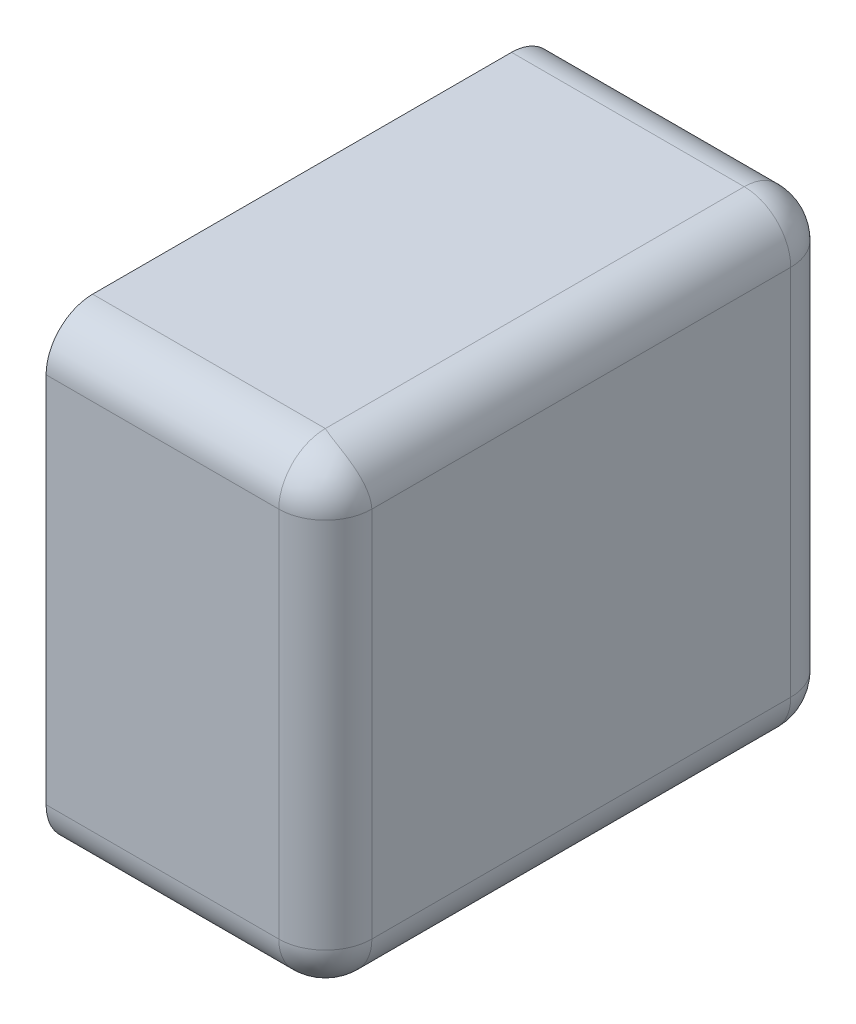
ISO-10303-21;
HEADER;
FILE_DESCRIPTION(('STEP AP214'),'2;1');
FILE_NAME('part.step','',(''),(''),'','','');
FILE_SCHEMA(('AUTOMOTIVE_DESIGN { 1 0 10303 214 1 1 1 1 }'));
ENDSEC;
DATA;
#1=APPLICATION_CONTEXT('core data for automotive mechanical design processes');
#2=APPLICATION_PROTOCOL_DEFINITION('international standard','automotive_design',2000,#1);
#3=PRODUCT_CONTEXT('',#1,'mechanical');
#4=PRODUCT('Part','Part','',(#3));
#5=PRODUCT_RELATED_PRODUCT_CATEGORY('part','',(#4));
#6=PRODUCT_DEFINITION_FORMATION('','',#4);
#7=PRODUCT_DEFINITION_CONTEXT('part definition',#1,'design');
#8=PRODUCT_DEFINITION('design','',#6,#7);
#9=PRODUCT_DEFINITION_SHAPE('','',#8);
#10=(LENGTH_UNIT() NAMED_UNIT(*) SI_UNIT(.MILLI.,.METRE.));
#11=(NAMED_UNIT(*) PLANE_ANGLE_UNIT() SI_UNIT($,.RADIAN.));
#12=(NAMED_UNIT(*) SI_UNIT($,.STERADIAN.) SOLID_ANGLE_UNIT());
#13=UNCERTAINTY_MEASURE_WITH_UNIT(LENGTH_MEASURE(1.E-05),#10,'distance_accuracy_value','');
#14=(GEOMETRIC_REPRESENTATION_CONTEXT(3) GLOBAL_UNCERTAINTY_ASSIGNED_CONTEXT((#13)) GLOBAL_UNIT_ASSIGNED_CONTEXT((#10,
#11,#12)) REPRESENTATION_CONTEXT('',''));
#15=CARTESIAN_POINT('',(0.,0.,0.));
#16=DIRECTION('',(0.,0.,1.));
#17=DIRECTION('',(1.,0.,0.));
#18=AXIS2_PLACEMENT_3D('',#15,#16,#17);
#19=CARTESIAN_POINT('',(0.45,0.125,0.5));
#20=DIRECTION('',(0.,1.,0.));
#21=DIRECTION('',(0.707106781186548,0.,0.707106781186548));
#22=AXIS2_PLACEMENT_3D('',#19,#20,#21);
#23=CYLINDRICAL_SURFACE('',#22,0.05);
#24=CARTESIAN_POINT('',(0.45,0.2,0.5));
#25=DIRECTION('',(0.,1.,0.));
#26=DIRECTION('',(0.,0.,1.));
#27=AXIS2_PLACEMENT_3D('',#24,#25,#26);
#28=CIRCLE('',#27,0.05);
#29=CARTESIAN_POINT('',(0.45,0.2,0.55));
#30=VERTEX_POINT('',#29);
#31=CARTESIAN_POINT('',(0.5,0.2,0.5));
#32=VERTEX_POINT('',#31);
#33=EDGE_CURVE('E11',#30,#32,#28,.T.);
#34=ORIENTED_EDGE('',*,*,#33,.F.);
#35=DIRECTION('',(0.,1.,0.));
#36=VECTOR('',#35,1.);
#37=CARTESIAN_POINT('',(0.45,0.125,0.55));
#38=LINE('',#37,#36);
#39=CARTESIAN_POINT('',(0.45,-0.2,0.55));
#40=VERTEX_POINT('',#39);
#41=EDGE_CURVE('E24',#40,#30,#38,.T.);
#42=ORIENTED_EDGE('',*,*,#41,.F.);
#43=CARTESIAN_POINT('',(0.45,-0.2,0.5));
#44=DIRECTION('',(0.,-1.,0.));
#45=DIRECTION('',(1.,0.,0.));
#46=AXIS2_PLACEMENT_3D('',#43,#44,#45);
#47=CIRCLE('',#46,0.05);
#48=CARTESIAN_POINT('',(0.5,-0.2,0.5));
#49=VERTEX_POINT('',#48);
#50=EDGE_CURVE('E322',#49,#40,#47,.T.);
#51=ORIENTED_EDGE('',*,*,#50,.F.);
#52=DIRECTION('',(0.,-1.,0.));
#53=VECTOR('',#52,1.);
#54=CARTESIAN_POINT('',(0.5,0.125,0.5));
#55=LINE('',#54,#53);
#56=EDGE_CURVE('E317',#32,#49,#55,.T.);
#57=ORIENTED_EDGE('',*,*,#56,.F.);
#58=EDGE_LOOP('',(#34,#42,#51,#57));
#59=FACE_BOUND('',#58,.T.);
#60=ADVANCED_FACE('F17',(#59),#23,.T.);
#61=CARTESIAN_POINT('',(0.45,-0.2,0.));
#62=DIRECTION('',(0.,0.,-1.));
#63=DIRECTION('',(0.707106781186548,-0.707106781186548,0.));
#64=AXIS2_PLACEMENT_3D('',#61,#62,#63);
#65=CYLINDRICAL_SURFACE('',#64,0.05);
#66=CARTESIAN_POINT('',(0.45,-0.2,0.05));
#67=DIRECTION('',(0.,0.,-1.));
#68=DIRECTION('',(1.,0.,0.));
#69=AXIS2_PLACEMENT_3D('',#66,#67,#68);
#70=CIRCLE('',#69,0.05);
#71=CARTESIAN_POINT('',(0.5,-0.2,0.05));
#72=VERTEX_POINT('',#71);
#73=CARTESIAN_POINT('',(0.45,-0.25,0.05));
#74=VERTEX_POINT('',#73);
#75=EDGE_CURVE('E313',#72,#74,#70,.T.);
#76=ORIENTED_EDGE('',*,*,#75,.F.);
#77=DIRECTION('',(0.,0.,-1.));
#78=VECTOR('',#77,1.);
#79=CARTESIAN_POINT('',(0.5,-0.2,0.));
#80=LINE('',#79,#78);
#81=EDGE_CURVE('E310',#49,#72,#80,.T.);
#82=ORIENTED_EDGE('',*,*,#81,.F.);
#83=CARTESIAN_POINT('',(0.45,-0.2,0.5));
#84=DIRECTION('',(0.,0.,1.));
#85=DIRECTION('',(0.,-1.,0.));
#86=AXIS2_PLACEMENT_3D('',#83,#84,#85);
#87=CIRCLE('',#86,0.05);
#88=CARTESIAN_POINT('',(0.45,-0.25,0.5));
#89=VERTEX_POINT('',#88);
#90=EDGE_CURVE('E307',#89,#49,#87,.T.);
#91=ORIENTED_EDGE('',*,*,#90,.F.);
#92=DIRECTION('',(0.,0.,1.));
#93=VECTOR('',#92,1.);
#94=CARTESIAN_POINT('',(0.45,-0.25,0.));
#95=LINE('',#94,#93);
#96=EDGE_CURVE('E302',#74,#89,#95,.T.);
#97=ORIENTED_EDGE('',*,*,#96,.F.);
#98=EDGE_LOOP('',(#76,#82,#91,#97));
#99=FACE_BOUND('',#98,.T.);
#100=ADVANCED_FACE('F336',(#99),#65,.T.);
#101=CARTESIAN_POINT('',(0.45,-0.2,0.5));
#102=DIRECTION('',(-0.408248290463863,-0.816496580927726,-0.408248290463863));
#103=DIRECTION('',(0.577350269189625,-0.577350269189626,0.577350269189626));
#104=AXIS2_PLACEMENT_3D('',#101,#102,#103);
#105=SPHERICAL_SURFACE('',#104,0.05);
#106=ORIENTED_EDGE('',*,*,#90,.T.);
#107=ORIENTED_EDGE('',*,*,#50,.T.);
#108=CARTESIAN_POINT('',(0.45,-0.2,0.5));
#109=DIRECTION('',(-1.,0.,0.));
#110=DIRECTION('',(0.,-0.707106781186547,0.707106781186548));
#111=AXIS2_PLACEMENT_3D('',#108,#109,#110);
#112=CIRCLE('',#111,0.05);
#113=EDGE_CURVE('E286',#89,#40,#112,.T.);
#114=ORIENTED_EDGE('',*,*,#113,.F.);
#115=EDGE_LOOP('',(#106,#107,#114));
#116=FACE_BOUND('',#115,.T.);
#117=ADVANCED_FACE('F328',(#116),#105,.T.);
#118=CARTESIAN_POINT('',(0.45,0.125,0.05));
#119=DIRECTION('',(0.,1.,0.));
#120=DIRECTION('',(0.707106781186548,0.,-0.707106781186547));
#121=AXIS2_PLACEMENT_3D('',#118,#119,#120);
#122=CYLINDRICAL_SURFACE('',#121,0.05);
#123=CARTESIAN_POINT('',(0.45,0.2,0.05));
#124=DIRECTION('',(0.,1.,0.));
#125=DIRECTION('',(1.,0.,0.));
#126=AXIS2_PLACEMENT_3D('',#123,#124,#125);
#127=CIRCLE('',#126,0.05);
#128=CARTESIAN_POINT('',(0.5,0.2,0.05));
#129=VERTEX_POINT('',#128);
#130=CARTESIAN_POINT('',(0.45,0.2,0.));
#131=VERTEX_POINT('',#130);
#132=EDGE_CURVE('E282',#129,#131,#127,.T.);
#133=ORIENTED_EDGE('',*,*,#132,.F.);
#134=DIRECTION('',(0.,1.,0.));
#135=VECTOR('',#134,1.);
#136=CARTESIAN_POINT('',(0.5,0.125,0.05));
#137=LINE('',#136,#135);
#138=EDGE_CURVE('E287',#72,#129,#137,.T.);
#139=ORIENTED_EDGE('',*,*,#138,.F.);
#140=CARTESIAN_POINT('',(0.45,-0.2,0.05));
#141=DIRECTION('',(0.,-1.,0.));
#142=DIRECTION('',(0.,0.,-1.));
#143=AXIS2_PLACEMENT_3D('',#140,#141,#142);
#144=CIRCLE('',#143,0.05);
#145=CARTESIAN_POINT('',(0.45,-0.2,0.));
#146=VERTEX_POINT('',#145);
#147=EDGE_CURVE('E290',#146,#72,#144,.T.);
#148=ORIENTED_EDGE('',*,*,#147,.F.);
#149=DIRECTION('',(0.,-1.,0.));
#150=VECTOR('',#149,1.);
#151=CARTESIAN_POINT('',(0.45,0.125,0.));
#152=LINE('',#151,#150);
#153=EDGE_CURVE('E278',#131,#146,#152,.T.);
#154=ORIENTED_EDGE('',*,*,#153,.F.);
#155=EDGE_LOOP('',(#133,#139,#148,#154));
#156=FACE_BOUND('',#155,.T.);
#157=ADVANCED_FACE('F289',(#156),#122,.T.);
#158=CARTESIAN_POINT('',(0.45,-0.2,0.05));
#159=DIRECTION('',(-0.408248290463863,0.408248290463863,-0.816496580927726));
#160=DIRECTION('',(0.577350269189626,-0.577350269189625,-0.577350269189626));
#161=AXIS2_PLACEMENT_3D('',#158,#159,#160);
#162=SPHERICAL_SURFACE('',#161,0.05);
#163=ORIENTED_EDGE('',*,*,#147,.T.);
#164=ORIENTED_EDGE('',*,*,#75,.T.);
#165=CARTESIAN_POINT('',(0.45,-0.2,0.05));
#166=DIRECTION('',(-1.,0.,0.));
#167=DIRECTION('',(0.,0.,-1.));
#168=AXIS2_PLACEMENT_3D('',#165,#166,#167);
#169=CIRCLE('',#168,0.05);
#170=EDGE_CURVE('E224',#146,#74,#169,.T.);
#171=ORIENTED_EDGE('',*,*,#170,.F.);
#172=EDGE_LOOP('',(#163,#164,#171));
#173=FACE_BOUND('',#172,.T.);
#174=ADVANCED_FACE('F184',(#173),#162,.T.);
#175=CARTESIAN_POINT('',(0.45,0.2,0.));
#176=DIRECTION('',(0.,0.,-1.));
#177=DIRECTION('',(0.707106781186548,0.707106781186548,0.));
#178=AXIS2_PLACEMENT_3D('',#175,#176,#177);
#179=CYLINDRICAL_SURFACE('',#178,0.05);
#180=CARTESIAN_POINT('',(0.45,0.2,0.05));
#181=DIRECTION('',(0.,0.,-1.));
#182=DIRECTION('',(0.,1.,0.));
#183=AXIS2_PLACEMENT_3D('',#180,#181,#182);
#184=CIRCLE('',#183,0.05);
#185=CARTESIAN_POINT('',(0.45,0.25,0.05));
#186=VERTEX_POINT('',#185);
#187=EDGE_CURVE('E219',#186,#129,#184,.T.);
#188=ORIENTED_EDGE('',*,*,#187,.F.);
#189=DIRECTION('',(0.,0.,-1.));
#190=VECTOR('',#189,1.);
#191=CARTESIAN_POINT('',(0.45,0.25,0.));
#192=LINE('',#191,#190);
#193=CARTESIAN_POINT('',(0.45,0.25,0.5));
#194=VERTEX_POINT('',#193);
#195=EDGE_CURVE('E216',#194,#186,#192,.T.);
#196=ORIENTED_EDGE('',*,*,#195,.F.);
#197=CARTESIAN_POINT('',(0.5,0.2,0.5));
#198=CARTESIAN_POINT('',(0.500000020313967,0.200831352427667,0.500056476640882));
#199=CARTESIAN_POINT('',(0.499979171317549,0.201662111124828,0.500121168311557));
#200=CARTESIAN_POINT('',(0.499895695565037,0.203324024248752,0.500265391195623));
#201=CARTESIAN_POINT('',(0.499832880868058,0.204155163571538,0.500344988001439));
#202=CARTESIAN_POINT('',(0.499665097579262,0.205815236106077,0.500517234671643));
#203=CARTESIAN_POINT('',(0.499559959502557,0.206644146794953,0.500609936033336));
#204=CARTESIAN_POINT('',(0.499307372398355,0.208297216645363,0.500806520816706));
#205=CARTESIAN_POINT('',(0.499159773963409,0.209121348357221,0.50091044290025));
#206=CARTESIAN_POINT('',(0.498822292392348,0.210762347249152,0.501127528752862));
#207=CARTESIAN_POINT('',(0.498632281058567,0.211579184426824,0.501240719867609));
#208=CARTESIAN_POINT('',(0.498210195281024,0.213203132016743,0.501474344176626));
#209=CARTESIAN_POINT('',(0.497978014684369,0.214010212271137,0.501594795122853));
#210=CARTESIAN_POINT('',(0.497472005262752,0.215612241167447,0.501840892195575));
#211=CARTESIAN_POINT('',(0.497198092814035,0.216407161843179,0.501966548375925));
#212=CARTESIAN_POINT('',(0.496609228401466,0.217982533533888,0.502220973549075));
#213=CARTESIAN_POINT('',(0.49629421548598,0.21876296105217,0.502349746928956));
#214=CARTESIAN_POINT('',(0.49562395131688,0.220307083417801,0.502608300810853));
#215=CARTESIAN_POINT('',(0.495268661584212,0.221070761417873,0.502738082163722));
#216=CARTESIAN_POINT('',(0.494518835357465,0.222579204861783,0.502996535248399));
#217=CARTESIAN_POINT('',(0.494124282319878,0.223323962166104,0.503125206487437));
#218=CARTESIAN_POINT('',(0.493297108379355,0.224792475072041,0.503379323912972));
#219=CARTESIAN_POINT('',(0.492864492001337,0.22551623315645,0.503504770480528));
#220=CARTESIAN_POINT('',(0.491962553597264,0.226940756399464,0.503750336828149));
#221=CARTESIAN_POINT('',(0.491493255977843,0.227641536413672,0.503870460068205));
#222=CARTESIAN_POINT('',(0.490519495705679,0.229018216920503,0.504103304064891));
#223=CARTESIAN_POINT('',(0.490015075848481,0.229694146209385,0.504216033516177));
#224=CARTESIAN_POINT('',(0.488972784289588,0.231019349498018,0.504432052512975));
#225=CARTESIAN_POINT('',(0.488434971990044,0.231668667602786,0.504535358057478));
#226=CARTESIAN_POINT('',(0.487327774609329,0.232938989255036,0.504730542154479));
#227=CARTESIAN_POINT('',(0.486758463484926,0.233560053368979,0.504822445957708));
#228=CARTESIAN_POINT('',(0.485590305843476,0.234772329390201,0.504992901649071));
#229=CARTESIAN_POINT('',(0.48499154553938,0.2353636192483,0.505071489829275));
#230=CARTESIAN_POINT('',(0.483766676890247,0.236514935275151,0.505213463043959));
#231=CARTESIAN_POINT('',(0.483140664496341,0.237075057459189,0.505276897009026));
#232=CARTESIAN_POINT('',(0.481863619839021,0.238162756781776,0.505386795425953));
#233=CARTESIAN_POINT('',(0.481212690558093,0.238690448425676,0.505433322818258));
#234=CARTESIAN_POINT('',(0.479888271236327,0.239712138796154,0.505507737338678));
#235=CARTESIAN_POINT('',(0.479214888348585,0.240206270678963,0.50553570253075));
#236=CARTESIAN_POINT('',(0.477848141278855,0.241159829885339,0.505571427793508));
#237=CARTESIAN_POINT('',(0.477154885445235,0.241619408903357,0.505579281877824));
#238=CARTESIAN_POINT('',(0.475751081087255,0.242502989090476,0.505573335713261));
#239=CARTESIAN_POINT('',(0.475040639060477,0.242927160099263,0.505559645939104));
#240=CARTESIAN_POINT('',(0.473605248184243,0.243739190835606,0.505509287643763));
#241=CARTESIAN_POINT('',(0.472880400913832,0.244127237870004,0.505472746231199));
#242=CARTESIAN_POINT('',(0.471419070457526,0.244866427926017,0.505375493621831));
#243=CARTESIAN_POINT('',(0.470682680895238,0.245217774756478,0.505314925981526));
#244=CARTESIAN_POINT('',(0.469201208347947,0.245883112710797,0.505168570932992));
#245=CARTESIAN_POINT('',(0.468456208087868,0.246197322893436,0.505082942970717));
#246=CARTESIAN_POINT('',(0.466960517038454,0.246788076154931,0.504885566112575));
#247=CARTESIAN_POINT('',(0.466209895271862,0.247064852010877,0.504773991607376));
#248=CARTESIAN_POINT('',(0.464706002926951,0.247580565826942,0.504523973299393));
#249=CARTESIAN_POINT('',(0.463952785138195,0.24781974846915,0.504385717519098));
#250=CARTESIAN_POINT('',(0.462446796385434,0.248260239191747,0.504081755398417));
#251=CARTESIAN_POINT('',(0.461694059537444,0.248461801820209,0.503916248962334));
#252=CARTESIAN_POINT('',(0.460192060427522,0.248827165694317,0.503557343726359));
#253=CARTESIAN_POINT('',(0.459442812292273,0.248991228948502,0.503364154831346));
#254=CARTESIAN_POINT('',(0.458321945507501,0.24920955873537,0.503052732369609));
#255=CARTESIAN_POINT('',(0.457949832604318,0.249277560154943,0.502945638881777));
#256=CARTESIAN_POINT('',(0.457207637428366,0.2494042588909,0.502724431166698));
#257=CARTESIAN_POINT('',(0.456837552741953,0.249462989767779,0.502610344441124));
#258=CARTESIAN_POINT('',(0.456099812695661,0.249571193360768,0.502375149481327));
#259=CARTESIAN_POINT('',(0.455732153421865,0.249620699753114,0.502254068989278));
#260=CARTESIAN_POINT('',(0.454999641822439,0.249710512986096,0.50200489200401));
#261=CARTESIAN_POINT('',(0.454634784141683,0.249750853511815,0.501876823418455));
#262=CARTESIAN_POINT('',(0.453908256305697,0.249822399896224,0.50161368768569));
#263=CARTESIAN_POINT('',(0.453546579332125,0.249853639363523,0.501478648512781));
#264=CARTESIAN_POINT('',(0.45282678964261,0.249907056499251,0.501201599789781));
#265=CARTESIAN_POINT('',(0.452468668656838,0.24992926760641,0.501059618183824));
#266=CARTESIAN_POINT('',(0.451756364451594,0.24996470752091,0.500768722771826));
#267=CARTESIAN_POINT('',(0.451402171529021,0.249977969507428,0.500619836783965));
#268=CARTESIAN_POINT('',(0.450698095332166,0.249995600075518,0.500315184973883));
#269=CARTESIAN_POINT('',(0.450348200942932,0.250000001475902,0.500159446731321));
#270=CARTESIAN_POINT('',(0.45,0.25,0.5));
#271=B_SPLINE_CURVE_WITH_KNOTS('',3,(#197,#198,#199,#200,#201,#202,#203,#204,#205,#206,#207,
#208,#209,#210,#211,#212,#213,#214,#215,#216,#217,#218,#219,#220,#221,#222,#223,#224,#225,#226,
#227,#228,#229,#230,#231,#232,#233,#234,#235,#236,#237,#238,#239,#240,#241,#242,#243,#244,#245,
#246,#247,#248,#249,#250,#251,#252,#253,#254,#255,#256,#257,#258,#259,#260,#261,#262,#263,#264,
#265,#266,#267,#268,#269,#270),.UNSPECIFIED.,.F.,.F.,(4,2,2,2,2,2,2,2,2,2,2,2,2,2,2,2,2,2,2,2,2,
2,2,2,2,2,2,2,2,2,2,2,2,2,2,2,4),(0.,0.00249945349828859,0.00501017636236177,
0.00753105510997416,0.0100609150362242,0.0125985278601288,0.015142619470862,0.017691877752768,
0.0202449604712909,0.0228005032044077,0.0253571273060391,0.0279134478892867,0.030468081818201,
0.0330196556971655,0.0355668138468769,0.0381082262553106,0.0406425964909796,0.0431686695642028,
0.0456852397199665,0.048191158143267,0.050685340554528,0.0531667746687544,0.0556345274875088,
0.0580877523875285,0.0605256959638786,0.0629477045789644,0.0653532305615734,0.0677418379925144,
0.0701132080055178,0.0712924926926686,0.0724674051483097,0.0736379404537153,0.0748041017706805,
0.0759659004268236,0.0771233559869032,0.0782764963093343,0.0794253575870825),.UNSPECIFIED.);
#272=EDGE_CURVE('E203',#32,#194,#271,.T.);
#273=ORIENTED_EDGE('',*,*,#272,.F.);
#274=DIRECTION('',(0.,0.,1.));
#275=VECTOR('',#274,1.);
#276=CARTESIAN_POINT('',(0.5,0.2,0.));
#277=LINE('',#276,#275);
#278=EDGE_CURVE('E193',#129,#32,#277,.T.);
#279=ORIENTED_EDGE('',*,*,#278,.F.);
#280=EDGE_LOOP('',(#188,#196,#273,#279));
#281=FACE_BOUND('',#280,.T.);
#282=ADVANCED_FACE('F177',(#281),#179,.T.);
#283=CARTESIAN_POINT('',(0.45,0.2,0.05));
#284=DIRECTION('',(-0.408248290463863,-0.408248290463863,-0.816496580927726));
#285=DIRECTION('',(0.577350269189626,0.577350269189626,-0.577350269189626));
#286=AXIS2_PLACEMENT_3D('',#283,#284,#285);
#287=SPHERICAL_SURFACE('',#286,0.05);
#288=ORIENTED_EDGE('',*,*,#187,.T.);
#289=ORIENTED_EDGE('',*,*,#132,.T.);
#290=CARTESIAN_POINT('',(0.45,0.2,0.05));
#291=DIRECTION('',(-1.,0.,0.));
#292=DIRECTION('',(0.,1.,0.));
#293=AXIS2_PLACEMENT_3D('',#290,#291,#292);
#294=CIRCLE('',#293,0.05);
#295=EDGE_CURVE('E159',#186,#131,#294,.T.);
#296=ORIENTED_EDGE('',*,*,#295,.F.);
#297=EDGE_LOOP('',(#288,#289,#296));
#298=FACE_BOUND('',#297,.T.);
#299=ADVANCED_FACE('F166',(#298),#287,.T.);
#300=CARTESIAN_POINT('',(0.45,0.2,0.5));
#301=DIRECTION('',(0.408248290463863,-0.816496580927727,0.408248290463862));
#302=DIRECTION('',(0.577350269189626,0.577350269189625,0.577350269189627));
#303=AXIS2_PLACEMENT_3D('',#300,#301,#302);
#304=SPHERICAL_SURFACE('',#303,0.05);
#305=ORIENTED_EDGE('',*,*,#33,.T.);
#306=ORIENTED_EDGE('',*,*,#272,.T.);
#307=CARTESIAN_POINT('',(0.45,0.2,0.5));
#308=DIRECTION('',(-1.,0.,0.));
#309=DIRECTION('',(0.,0.707106781186547,0.707106781186548));
#310=AXIS2_PLACEMENT_3D('',#307,#308,#309);
#311=CIRCLE('',#310,0.05);
#312=EDGE_CURVE('E155',#30,#194,#311,.T.);
#313=ORIENTED_EDGE('',*,*,#312,.F.);
#314=EDGE_LOOP('',(#305,#306,#313));
#315=FACE_BOUND('',#314,.T.);
#316=ADVANCED_FACE('F176',(#315),#304,.T.);
#317=CARTESIAN_POINT('',(0.425,-0.2,0.05));
#318=DIRECTION('',(1.,0.,0.));
#319=DIRECTION('',(0.,-0.707106781186547,-0.707106781186548));
#320=AXIS2_PLACEMENT_3D('',#317,#318,#319);
#321=CYLINDRICAL_SURFACE('',#320,0.05);
#322=ORIENTED_EDGE('',*,*,#170,.T.);
#323=DIRECTION('',(1.,0.,0.));
#324=VECTOR('',#323,1.);
#325=CARTESIAN_POINT('',(0.425,-0.25,0.05));
#326=LINE('',#325,#324);
#327=CARTESIAN_POINT('',(0.2,-0.25,0.05));
#328=VERTEX_POINT('',#327);
#329=EDGE_CURVE('E150',#328,#74,#326,.T.);
#330=ORIENTED_EDGE('',*,*,#329,.F.);
#331=CARTESIAN_POINT('',(0.2,-0.2,0.05));
#332=DIRECTION('',(-1.,0.,0.));
#333=DIRECTION('',(0.,-0.707106781186547,-0.707106781186548));
#334=AXIS2_PLACEMENT_3D('',#331,#332,#333);
#335=CIRCLE('',#334,0.05);
#336=CARTESIAN_POINT('',(0.2,-0.2,0.));
#337=VERTEX_POINT('',#336);
#338=EDGE_CURVE('E147',#337,#328,#335,.T.);
#339=ORIENTED_EDGE('',*,*,#338,.F.);
#340=DIRECTION('',(-1.,0.,0.));
#341=VECTOR('',#340,1.);
#342=CARTESIAN_POINT('',(0.425,-0.2,0.));
#343=LINE('',#342,#341);
#344=EDGE_CURVE('E142',#146,#337,#343,.T.);
#345=ORIENTED_EDGE('',*,*,#344,.F.);
#346=EDGE_LOOP('',(#322,#330,#339,#345));
#347=FACE_BOUND('',#346,.T.);
#348=ADVANCED_FACE('F243',(#347),#321,.T.);
#349=CARTESIAN_POINT('',(0.35,0.,0.));
#350=DIRECTION('',(0.,0.,-1.));
#351=DIRECTION('',(-1.,0.,0.));
#352=AXIS2_PLACEMENT_3D('',#349,#350,#351);
#353=PLANE('',#352);
#354=ORIENTED_EDGE('',*,*,#153,.T.);
#355=ORIENTED_EDGE('',*,*,#344,.T.);
#356=DIRECTION('',(0.,1.,0.));
#357=VECTOR('',#356,1.);
#358=CARTESIAN_POINT('',(0.2,-0.25,0.));
#359=LINE('',#358,#357);
#360=CARTESIAN_POINT('',(0.2,0.2,0.));
#361=VERTEX_POINT('',#360);
#362=EDGE_CURVE('E140',#337,#361,#359,.T.);
#363=ORIENTED_EDGE('',*,*,#362,.T.);
#364=DIRECTION('',(1.,0.,0.));
#365=VECTOR('',#364,1.);
#366=CARTESIAN_POINT('',(0.275,0.2,0.));
#367=LINE('',#366,#365);
#368=EDGE_CURVE('E135',#361,#131,#367,.T.);
#369=ORIENTED_EDGE('',*,*,#368,.T.);
#370=EDGE_LOOP('',(#354,#355,#363,#369));
#371=FACE_BOUND('',#370,.T.);
#372=ADVANCED_FACE('F252',(#371),#353,.T.);
#373=CARTESIAN_POINT('',(0.275,0.2,0.05));
#374=DIRECTION('',(-1.,0.,0.));
#375=DIRECTION('',(0.,0.707106781186547,-0.707106781186548));
#376=AXIS2_PLACEMENT_3D('',#373,#374,#375);
#377=CYLINDRICAL_SURFACE('',#376,0.05);
#378=ORIENTED_EDGE('',*,*,#295,.T.);
#379=ORIENTED_EDGE('',*,*,#368,.F.);
#380=CARTESIAN_POINT('',(0.2,0.2,0.05));
#381=DIRECTION('',(-1.,0.,0.));
#382=DIRECTION('',(0.,0.707106781186547,-0.707106781186548));
#383=AXIS2_PLACEMENT_3D('',#380,#381,#382);
#384=CIRCLE('',#383,0.05);
#385=CARTESIAN_POINT('',(0.2,0.25,0.05));
#386=VERTEX_POINT('',#385);
#387=EDGE_CURVE('E132',#386,#361,#384,.T.);
#388=ORIENTED_EDGE('',*,*,#387,.F.);
#389=DIRECTION('',(-1.,0.,0.));
#390=VECTOR('',#389,1.);
#391=CARTESIAN_POINT('',(0.275,0.25,0.05));
#392=LINE('',#391,#390);
#393=EDGE_CURVE('E127',#186,#386,#392,.T.);
#394=ORIENTED_EDGE('',*,*,#393,.F.);
#395=EDGE_LOOP('',(#378,#379,#388,#394));
#396=FACE_BOUND('',#395,.T.);
#397=ADVANCED_FACE('F256',(#396),#377,.T.);
#398=CARTESIAN_POINT('',(0.2,0.25,0.));
#399=DIRECTION('',(0.,-1.,0.));
#400=DIRECTION('',(1.,0.,0.));
#401=AXIS2_PLACEMENT_3D('',#398,#399,#400);
#402=PLANE('',#401);
#403=ORIENTED_EDGE('',*,*,#195,.T.);
#404=ORIENTED_EDGE('',*,*,#393,.T.);
#405=DIRECTION('',(0.,0.,1.));
#406=VECTOR('',#405,1.);
#407=CARTESIAN_POINT('',(0.2,0.25,0.));
#408=LINE('',#407,#406);
#409=CARTESIAN_POINT('',(0.2,0.25,0.5));
#410=VERTEX_POINT('',#409);
#411=EDGE_CURVE('E125',#386,#410,#408,.T.);
#412=ORIENTED_EDGE('',*,*,#411,.T.);
#413=DIRECTION('',(1.,0.,0.));
#414=VECTOR('',#413,1.);
#415=CARTESIAN_POINT('',(0.275,0.25,0.5));
#416=LINE('',#415,#414);
#417=EDGE_CURVE('E97',#410,#194,#416,.T.);
#418=ORIENTED_EDGE('',*,*,#417,.T.);
#419=EDGE_LOOP('',(#403,#404,#412,#418));
#420=FACE_BOUND('',#419,.T.);
#421=ADVANCED_FACE('F261',(#420),#402,.F.);
#422=CARTESIAN_POINT('',(0.5,0.25,0.));
#423=DIRECTION('',(-1.,0.,0.));
#424=DIRECTION('',(0.,-1.,0.));
#425=AXIS2_PLACEMENT_3D('',#422,#423,#424);
#426=PLANE('',#425);
#427=ORIENTED_EDGE('',*,*,#56,.T.);
#428=ORIENTED_EDGE('',*,*,#81,.T.);
#429=ORIENTED_EDGE('',*,*,#138,.T.);
#430=ORIENTED_EDGE('',*,*,#278,.T.);
#431=EDGE_LOOP('',(#427,#428,#429,#430));
#432=FACE_BOUND('',#431,.T.);
#433=ADVANCED_FACE('F339',(#432),#426,.F.);
#434=CARTESIAN_POINT('',(0.425,-0.2,0.5));
#435=DIRECTION('',(1.,0.,0.));
#436=DIRECTION('',(0.,-0.707106781186547,0.707106781186548));
#437=AXIS2_PLACEMENT_3D('',#434,#435,#436);
#438=CYLINDRICAL_SURFACE('',#437,0.05);
#439=ORIENTED_EDGE('',*,*,#113,.T.);
#440=DIRECTION('',(1.,0.,0.));
#441=VECTOR('',#440,1.);
#442=CARTESIAN_POINT('',(0.425,-0.2,0.55));
#443=LINE('',#442,#441);
#444=CARTESIAN_POINT('',(0.2,-0.2,0.55));
#445=VERTEX_POINT('',#444);
#446=EDGE_CURVE('E120',#445,#40,#443,.T.);
#447=ORIENTED_EDGE('',*,*,#446,.F.);
#448=CARTESIAN_POINT('',(0.2,-0.2,0.5));
#449=DIRECTION('',(-1.,0.,0.));
#450=DIRECTION('',(0.,-0.707106781186547,0.707106781186548));
#451=AXIS2_PLACEMENT_3D('',#448,#449,#450);
#452=CIRCLE('',#451,0.05);
#453=CARTESIAN_POINT('',(0.2,-0.25,0.5));
#454=VERTEX_POINT('',#453);
#455=EDGE_CURVE('E112',#454,#445,#452,.T.);
#456=ORIENTED_EDGE('',*,*,#455,.F.);
#457=DIRECTION('',(-1.,0.,0.));
#458=VECTOR('',#457,1.);
#459=CARTESIAN_POINT('',(0.425,-0.25,0.5));
#460=LINE('',#459,#458);
#461=EDGE_CURVE('E116',#89,#454,#460,.T.);
#462=ORIENTED_EDGE('',*,*,#461,.F.);
#463=EDGE_LOOP('',(#439,#447,#456,#462));
#464=FACE_BOUND('',#463,.T.);
#465=ADVANCED_FACE('F331',(#464),#438,.T.);
#466=CARTESIAN_POINT('',(0.5,-0.25,0.));
#467=DIRECTION('',(0.,1.,0.));
#468=DIRECTION('',(-1.,0.,0.));
#469=AXIS2_PLACEMENT_3D('',#466,#467,#468);
#470=PLANE('',#469);
#471=ORIENTED_EDGE('',*,*,#96,.T.);
#472=ORIENTED_EDGE('',*,*,#461,.T.);
#473=DIRECTION('',(0.,0.,1.));
#474=VECTOR('',#473,1.);
#475=CARTESIAN_POINT('',(0.2,-0.25,0.));
#476=LINE('',#475,#474);
#477=EDGE_CURVE('E101',#328,#454,#476,.T.);
#478=ORIENTED_EDGE('',*,*,#477,.F.);
#479=ORIENTED_EDGE('',*,*,#329,.T.);
#480=EDGE_LOOP('',(#471,#472,#478,#479));
#481=FACE_BOUND('',#480,.T.);
#482=ADVANCED_FACE('F333',(#481),#470,.F.);
#483=CARTESIAN_POINT('',(0.275,0.2,0.5));
#484=DIRECTION('',(-1.,0.,0.));
#485=DIRECTION('',(0.,0.707106781186547,0.707106781186548));
#486=AXIS2_PLACEMENT_3D('',#483,#484,#485);
#487=CYLINDRICAL_SURFACE('',#486,0.05);
#488=ORIENTED_EDGE('',*,*,#312,.T.);
#489=ORIENTED_EDGE('',*,*,#417,.F.);
#490=CARTESIAN_POINT('',(0.2,0.2,0.5));
#491=DIRECTION('',(-1.,0.,0.));
#492=DIRECTION('',(0.,0.707106781186547,0.707106781186548));
#493=AXIS2_PLACEMENT_3D('',#490,#491,#492);
#494=CIRCLE('',#493,0.05);
#495=CARTESIAN_POINT('',(0.2,0.2,0.55));
#496=VERTEX_POINT('',#495);
#497=EDGE_CURVE('E91',#496,#410,#494,.T.);
#498=ORIENTED_EDGE('',*,*,#497,.F.);
#499=DIRECTION('',(-1.,0.,0.));
#500=VECTOR('',#499,1.);
#501=CARTESIAN_POINT('',(0.275,0.2,0.55));
#502=LINE('',#501,#500);
#503=EDGE_CURVE('E95',#30,#496,#502,.T.);
#504=ORIENTED_EDGE('',*,*,#503,.F.);
#505=EDGE_LOOP('',(#488,#489,#498,#504));
#506=FACE_BOUND('',#505,.T.);
#507=ADVANCED_FACE('F94',(#506),#487,.T.);
#508=CARTESIAN_POINT('',(0.2,-0.25,0.));
#509=DIRECTION('',(1.,0.,0.));
#510=DIRECTION('',(0.,1.,0.));
#511=AXIS2_PLACEMENT_3D('',#508,#509,#510);
#512=PLANE('',#511);
#513=ORIENTED_EDGE('',*,*,#455,.T.);
#514=DIRECTION('',(0.,1.,0.));
#515=VECTOR('',#514,1.);
#516=CARTESIAN_POINT('',(0.2,-0.25,0.55));
#517=LINE('',#516,#515);
#518=EDGE_CURVE('E107',#445,#496,#517,.T.);
#519=ORIENTED_EDGE('',*,*,#518,.T.);
#520=ORIENTED_EDGE('',*,*,#497,.T.);
#521=ORIENTED_EDGE('',*,*,#411,.F.);
#522=ORIENTED_EDGE('',*,*,#387,.T.);
#523=ORIENTED_EDGE('',*,*,#362,.F.);
#524=ORIENTED_EDGE('',*,*,#338,.T.);
#525=ORIENTED_EDGE('',*,*,#477,.T.);
#526=EDGE_LOOP('',(#513,#519,#520,#521,#522,#523,#524,#525));
#527=FACE_BOUND('',#526,.T.);
#528=ADVANCED_FACE('F110',(#527),#512,.F.);
#529=CARTESIAN_POINT('',(0.35,0.,0.55));
#530=DIRECTION('',(0.,0.,-1.));
#531=DIRECTION('',(-1.,0.,0.));
#532=AXIS2_PLACEMENT_3D('',#529,#530,#531);
#533=PLANE('',#532);
#534=ORIENTED_EDGE('',*,*,#41,.T.);
#535=ORIENTED_EDGE('',*,*,#503,.T.);
#536=ORIENTED_EDGE('',*,*,#518,.F.);
#537=ORIENTED_EDGE('',*,*,#446,.T.);
#538=EDGE_LOOP('',(#534,#535,#536,#537));
#539=FACE_BOUND('',#538,.T.);
#540=ADVANCED_FACE('F105',(#539),#533,.F.);
#541=CLOSED_SHELL('',(#60,#100,#117,#157,#174,#282,#299,#316,#348,#372,#397,#421,#433,#465,#482,
#507,#528,#540));
#542=MANIFOLD_SOLID_BREP('B1',#541);
#543=ADVANCED_BREP_SHAPE_REPRESENTATION('',(#18,#542),#14);
#544=SHAPE_DEFINITION_REPRESENTATION(#9,#543);
ENDSEC;
END-ISO-10303-21;
